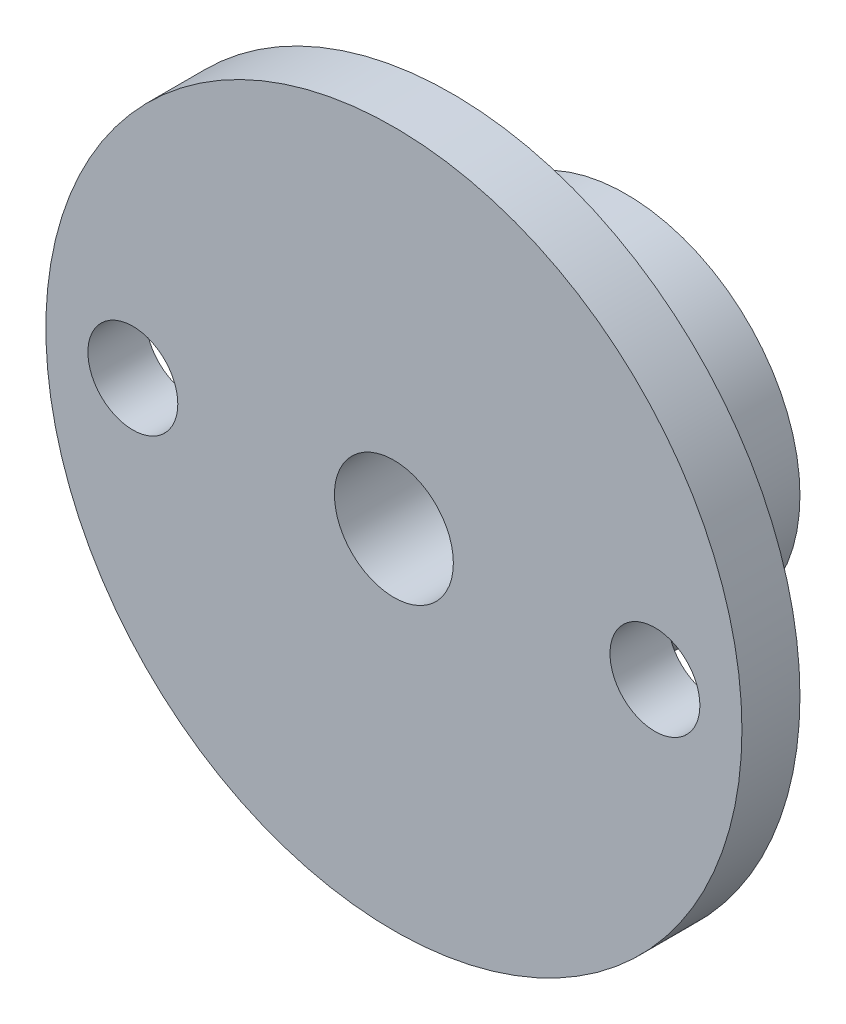
ISO-10303-21;
HEADER;
FILE_DESCRIPTION(('STEP AP214'),'2;1');
FILE_NAME('part.step','',(''),(''),'','','');
FILE_SCHEMA(('AUTOMOTIVE_DESIGN { 1 0 10303 214 1 1 1 1 }'));
ENDSEC;
DATA;
#1=APPLICATION_CONTEXT('core data for automotive mechanical design processes');
#2=APPLICATION_PROTOCOL_DEFINITION('international standard','automotive_design',2000,#1);
#3=PRODUCT_CONTEXT('',#1,'mechanical');
#4=PRODUCT('Part','Part','',(#3));
#5=PRODUCT_RELATED_PRODUCT_CATEGORY('part','',(#4));
#6=PRODUCT_DEFINITION_FORMATION('','',#4);
#7=PRODUCT_DEFINITION_CONTEXT('part definition',#1,'design');
#8=PRODUCT_DEFINITION('design','',#6,#7);
#9=PRODUCT_DEFINITION_SHAPE('','',#8);
#10=(LENGTH_UNIT() NAMED_UNIT(*) SI_UNIT(.MILLI.,.METRE.));
#11=(NAMED_UNIT(*) PLANE_ANGLE_UNIT() SI_UNIT($,.RADIAN.));
#12=(NAMED_UNIT(*) SI_UNIT($,.STERADIAN.) SOLID_ANGLE_UNIT());
#13=UNCERTAINTY_MEASURE_WITH_UNIT(LENGTH_MEASURE(1.E-05),#10,'distance_accuracy_value','');
#14=(GEOMETRIC_REPRESENTATION_CONTEXT(3) GLOBAL_UNCERTAINTY_ASSIGNED_CONTEXT((#13)) GLOBAL_UNIT_ASSIGNED_CONTEXT((#10,
#11,#12)) REPRESENTATION_CONTEXT('',''));
#15=CARTESIAN_POINT('',(0.,0.,0.));
#16=DIRECTION('',(0.,0.,1.));
#17=DIRECTION('',(1.,0.,0.));
#18=AXIS2_PLACEMENT_3D('',#15,#16,#17);
#19=CARTESIAN_POINT('',(0.,0.,6.));
#20=DIRECTION('',(0.,0.,-1.));
#21=DIRECTION('',(-1.,0.,0.));
#22=AXIS2_PLACEMENT_3D('',#19,#20,#21);
#23=CYLINDRICAL_SURFACE('',#22,6.);
#24=CARTESIAN_POINT('',(0.,-6.,4.5));
#25=CARTESIAN_POINT('',(0.0828760886697294,-5.99999859868013,4.49999767426184));
#26=CARTESIAN_POINT('',(0.165778157830762,-5.99826578131828,4.49310844922621));
#27=CARTESIAN_POINT('',(0.329206323770531,-5.99152113829892,4.465774848693));
#28=CARTESIAN_POINT('',(0.409731046870737,-5.98650745419968,4.44532279046215));
#29=CARTESIAN_POINT('',(0.566020872182575,-5.9737562633204,4.39156074653791));
#30=CARTESIAN_POINT('',(0.641791563430001,-5.96602202842087,4.35826620128472));
#31=CARTESIAN_POINT('',(0.786672131904424,-5.94865343807593,4.27981860995517));
#32=CARTESIAN_POINT('',(0.855781784348757,-5.9390190185405,4.23466516388106));
#33=CARTESIAN_POINT('',(0.986801927300918,-5.91867413591801,4.13279921034579));
#34=CARTESIAN_POINT('',(1.04855569006107,-5.90794707148533,4.07588842504082));
#35=CARTESIAN_POINT('',(1.1617489272033,-5.8867362011753,3.95254779509108));
#36=CARTESIAN_POINT('',(1.21318723694913,-5.87625242288349,3.8861168770535));
#37=CARTESIAN_POINT('',(1.30502654279903,-5.8565477569971,3.74440477326256));
#38=CARTESIAN_POINT('',(1.34525221592535,-5.84734794470605,3.6690067691896));
#39=CARTESIAN_POINT('',(1.41239690855053,-5.83149494812223,3.51225158834164));
#40=CARTESIAN_POINT('',(1.43931805543933,-5.82484135672789,3.43089536667424));
#41=CARTESIAN_POINT('',(1.47855483680429,-5.81500476717551,3.26625650179753));
#42=CARTESIAN_POINT('',(1.49115226833334,-5.81175491075426,3.1830451039502));
#43=CARTESIAN_POINT('',(1.50226177506785,-5.80889362537741,3.01563143098602));
#44=CARTESIAN_POINT('',(1.50077614181798,-5.80928160448644,2.93142931930139));
#45=CARTESIAN_POINT('',(1.48398652463928,-5.81359205496618,2.76658419225552));
#46=CARTESIAN_POINT('',(1.46901834019052,-5.81742863001879,2.68590437853491));
#47=CARTESIAN_POINT('',(1.4262241869031,-5.82806709676484,2.52823894908871));
#48=CARTESIAN_POINT('',(1.39839730206942,-5.83486919970697,2.45125359697102));
#49=CARTESIAN_POINT('',(1.33038947793715,-5.85075113904187,2.30226198374794));
#50=CARTESIAN_POINT('',(1.29008666723291,-5.85985327469421,2.23031382821045));
#51=CARTESIAN_POINT('',(1.19835627601495,-5.87929710846386,2.09408129024316));
#52=CARTESIAN_POINT('',(1.14692674880884,-5.88963902334735,2.02979825193275));
#53=CARTESIAN_POINT('',(1.03266342468122,-5.91075880539781,1.9087963843056));
#54=CARTESIAN_POINT('',(0.969546258165859,-5.92154069477971,1.85234550993865));
#55=CARTESIAN_POINT('',(0.834611917503699,-5.94205965578786,1.7507787575361));
#56=CARTESIAN_POINT('',(0.762794477707943,-5.95179669549415,1.70566322573644));
#57=CARTESIAN_POINT('',(0.612115888681391,-5.96917732094183,1.62794941377562));
#58=CARTESIAN_POINT('',(0.533231393208623,-5.97681360127725,1.59539465974557));
#59=CARTESIAN_POINT('',(0.370876008142882,-5.98907916991419,1.54408269429043));
#60=CARTESIAN_POINT('',(0.287405999150484,-5.99370903339281,1.52532284358186));
#61=CARTESIAN_POINT('',(0.120539970390026,-5.99935499271375,1.50254243444116));
#62=CARTESIAN_POINT('',(0.0371967199882084,-6.00046053508279,1.4981569739247));
#63=CARTESIAN_POINT('',(-0.129032874801509,-5.99918804814451,1.50324900205549));
#64=CARTESIAN_POINT('',(-0.211919259644596,-5.99681033241847,1.51272524279913));
#65=CARTESIAN_POINT('',(-0.373614268776493,-5.98889581127357,1.54497090839138));
#66=CARTESIAN_POINT('',(-0.452465118968756,-5.98340634185811,1.56754126347699));
#67=CARTESIAN_POINT('',(-0.605257292452512,-5.96988706634134,1.62510708402845));
#68=CARTESIAN_POINT('',(-0.679198119032636,-5.96185700369892,1.66010380431317));
#69=CARTESIAN_POINT('',(-0.821523134429848,-5.9439330792631,1.74223612887473));
#70=CARTESIAN_POINT('',(-0.889785441835831,-5.93400867366932,1.78957611239676));
#71=CARTESIAN_POINT('',(-1.01752661364325,-5.91344509187419,1.89478990879697));
#72=CARTESIAN_POINT('',(-1.07700395897301,-5.90280579251705,1.95266553961691));
#73=CARTESIAN_POINT('',(-1.18699056807273,-5.88168956960771,2.07900196084446));
#74=CARTESIAN_POINT('',(-1.23724386762203,-5.87122304187281,2.14768770300242));
#75=CARTESIAN_POINT('',(-1.3255107590127,-5.85192878377239,2.29273263446572));
#76=CARTESIAN_POINT('',(-1.36352489415794,-5.84310098067026,2.36909148295975));
#77=CARTESIAN_POINT('',(-1.42595142060929,-5.82818094734665,2.52690572241308));
#78=CARTESIAN_POINT('',(-1.45044439665407,-5.82207255291906,2.60832762834401));
#79=CARTESIAN_POINT('',(-1.48534565995378,-5.81326744090184,2.77430963788911));
#80=CARTESIAN_POINT('',(-1.49575702747866,-5.81056997719936,2.85886905103249));
#81=CARTESIAN_POINT('',(-1.502038590334,-5.80894901203957,3.0261210238552));
#82=CARTESIAN_POINT('',(-1.49831789778012,-5.80991932728264,3.10879743512473));
#83=CARTESIAN_POINT('',(-1.47737727831287,-5.81527909007843,3.27230388866798));
#84=CARTESIAN_POINT('',(-1.46015762268677,-5.81966846891857,3.35313396801365));
#85=CARTESIAN_POINT('',(-1.4129313194428,-5.83131260682723,3.51020845906541));
#86=CARTESIAN_POINT('',(-1.38300140468038,-5.83855015236309,3.58647730524021));
#87=CARTESIAN_POINT('',(-1.31126491360507,-5.85507755724829,3.73296538271369));
#88=CARTESIAN_POINT('',(-1.26945669003419,-5.86436770120773,3.80318377318692));
#89=CARTESIAN_POINT('',(-1.17386774863714,-5.88425634263512,3.93755462900202));
#90=CARTESIAN_POINT('',(-1.11980316291226,-5.89488264831757,4.00150107342396));
#91=CARTESIAN_POINT('',(-1.00178937118974,-5.91608027246286,4.11954704479541));
#92=CARTESIAN_POINT('',(-0.937837821261147,-5.9266515772706,4.17364423011297));
#93=CARTESIAN_POINT('',(-0.800467586702591,-5.94677655647663,4.27141130856461));
#94=CARTESIAN_POINT('',(-0.726898422316388,-5.95630833365868,4.31487461367158));
#95=CARTESIAN_POINT('',(-0.573266059510478,-5.97304924975118,4.38874746294053));
#96=CARTESIAN_POINT('',(-0.493207563436741,-5.98026005199781,4.41916636064854));
#97=CARTESIAN_POINT('',(-0.344410253243474,-5.99048059565542,4.46157183032965));
#98=CARTESIAN_POINT('',(-0.27638017090807,-5.99402585052691,4.47595124305343));
#99=CARTESIAN_POINT('',(-0.138906071536285,-5.99878605231948,4.49516594362194));
#100=CARTESIAN_POINT('',(-0.0694621612426181,-6.00000117450894,4.5000019493053));
#101=CARTESIAN_POINT('',(0.,-6.,4.5));
#102=B_SPLINE_CURVE_WITH_KNOTS('',3,(#24,#25,#26,#27,#28,#29,#30,#31,#32,#33,#34,#35,#36,#37,
#38,#39,#40,#41,#42,#43,#44,#45,#46,#47,#48,#49,#50,#51,#52,#53,#54,#55,#56,#57,#58,#59,#60,#61,
#62,#63,#64,#65,#66,#67,#68,#69,#70,#71,#72,#73,#74,#75,#76,#77,#78,#79,#80,#81,#82,#83,#84,#85,
#86,#87,#88,#89,#90,#91,#92,#93,#94,#95,#96,#97,#98,#99,#100,#101),.UNSPECIFIED.,.T.,.F.,(4,2,2,
2,2,2,2,2,2,2,2,2,2,2,2,2,2,2,2,2,2,2,2,2,2,2,2,2,2,2,2,2,2,2,2,2,2,2,4),(0.,0.24837371247189,
0.496888237763899,0.745104902286106,0.993329940169327,1.24614435437139,1.49898729580062,
1.75558647545807,2.01214461169368,2.2635629509943,2.51494038112697,2.76022497007018,
3.00552703466038,3.25330527873879,3.50112690836163,3.75601500969019,4.01091089558247,
4.26668229009114,4.52240473688643,4.77158308949276,5.02073901112743,5.26620274514037,
5.5116912732229,5.76153587565352,6.01142363008019,6.26744509204476,6.52345518749508,
6.77792254614036,7.03233423252408,7.27943780398612,7.52653640956034,7.77216400559447,
8.01782568136901,8.2698957640991,8.52202569770417,8.77872185499588,9.0352336382135,
9.24342242942149,9.45159556043039),.UNSPECIFIED.);
#103=CARTESIAN_POINT('',(0.,-6.,4.5));
#104=VERTEX_POINT('',#103);
#105=EDGE_CURVE('E66',#104,#104,#102,.T.);
#106=ORIENTED_EDGE('',*,*,#105,.T.);
#107=EDGE_LOOP('',(#106));
#108=FACE_BOUND('',#107,.T.);
#109=CARTESIAN_POINT('',(0.,0.,6.));
#110=DIRECTION('',(0.,0.,1.));
#111=DIRECTION('',(1.,0.,0.));
#112=AXIS2_PLACEMENT_3D('',#109,#110,#111);
#113=CIRCLE('',#112,6.);
#114=CARTESIAN_POINT('',(6.,0.,6.));
#115=VERTEX_POINT('',#114);
#116=EDGE_CURVE('E10',#115,#115,#113,.T.);
#117=ORIENTED_EDGE('',*,*,#116,.F.);
#118=EDGE_LOOP('',(#117));
#119=FACE_BOUND('',#118,.T.);
#120=CARTESIAN_POINT('',(0.,0.,0.));
#121=DIRECTION('',(0.,0.,1.));
#122=DIRECTION('',(1.,0.,0.));
#123=AXIS2_PLACEMENT_3D('',#120,#121,#122);
#124=CIRCLE('',#123,6.);
#125=CARTESIAN_POINT('',(6.,0.,0.));
#126=VERTEX_POINT('',#125);
#127=EDGE_CURVE('E36',#126,#126,#124,.T.);
#128=ORIENTED_EDGE('',*,*,#127,.T.);
#129=EDGE_LOOP('',(#128));
#130=FACE_BOUND('',#129,.T.);
#131=ADVANCED_FACE('F24',(#108,#119,#130),#23,.T.);
#132=CARTESIAN_POINT('',(0.,0.,0.));
#133=DIRECTION('',(0.,0.,1.));
#134=DIRECTION('',(1.,0.,0.));
#135=AXIS2_PLACEMENT_3D('',#132,#133,#134);
#136=PLANE('',#135);
#137=CARTESIAN_POINT('',(0.,0.,0.));
#138=DIRECTION('',(0.,0.,1.));
#139=DIRECTION('',(1.,0.,0.));
#140=AXIS2_PLACEMENT_3D('',#137,#138,#139);
#141=CIRCLE('',#140,2.05);
#142=CARTESIAN_POINT('',(2.05,0.,0.));
#143=VERTEX_POINT('',#142);
#144=EDGE_CURVE('E48',#143,#143,#141,.T.);
#145=ORIENTED_EDGE('',*,*,#144,.T.);
#146=EDGE_LOOP('',(#145));
#147=FACE_BOUND('',#146,.T.);
#148=ORIENTED_EDGE('',*,*,#127,.F.);
#149=EDGE_LOOP('',(#148));
#150=FACE_BOUND('',#149,.T.);
#151=ADVANCED_FACE('F93',(#147,#150),#136,.F.);
#152=CARTESIAN_POINT('',(0.,0.,6.));
#153=DIRECTION('',(0.,0.,1.));
#154=DIRECTION('',(1.,0.,0.));
#155=AXIS2_PLACEMENT_3D('',#152,#153,#154);
#156=PLANE('',#155);
#157=CARTESIAN_POINT('',(9.,0.,6.));
#158=DIRECTION('',(0.,0.,1.));
#159=DIRECTION('',(1.,0.,0.));
#160=AXIS2_PLACEMENT_3D('',#157,#158,#159);
#161=CIRCLE('',#160,1.55);
#162=CARTESIAN_POINT('',(10.55,0.,6.));
#163=VERTEX_POINT('',#162);
#164=EDGE_CURVE('E60',#163,#163,#161,.T.);
#165=ORIENTED_EDGE('',*,*,#164,.T.);
#166=EDGE_LOOP('',(#165));
#167=FACE_BOUND('',#166,.T.);
#168=CARTESIAN_POINT('',(-9.,0.,6.));
#169=DIRECTION('',(0.,0.,1.));
#170=DIRECTION('',(1.,0.,0.));
#171=AXIS2_PLACEMENT_3D('',#168,#169,#170);
#172=CIRCLE('',#171,1.55);
#173=CARTESIAN_POINT('',(-7.45,0.,6.));
#174=VERTEX_POINT('',#173);
#175=EDGE_CURVE('E54',#174,#174,#172,.T.);
#176=ORIENTED_EDGE('',*,*,#175,.T.);
#177=EDGE_LOOP('',(#176));
#178=FACE_BOUND('',#177,.T.);
#179=CARTESIAN_POINT('',(0.,0.,6.));
#180=DIRECTION('',(0.,0.,1.));
#181=DIRECTION('',(1.,0.,0.));
#182=AXIS2_PLACEMENT_3D('',#179,#180,#181);
#183=CIRCLE('',#182,12.);
#184=CARTESIAN_POINT('',(12.,0.,6.));
#185=VERTEX_POINT('',#184);
#186=EDGE_CURVE('E45',#185,#185,#183,.T.);
#187=ORIENTED_EDGE('',*,*,#186,.F.);
#188=EDGE_LOOP('',(#187));
#189=FACE_BOUND('',#188,.T.);
#190=ORIENTED_EDGE('',*,*,#116,.T.);
#191=EDGE_LOOP('',(#190));
#192=FACE_BOUND('',#191,.T.);
#193=ADVANCED_FACE('F89',(#167,#178,#189,#192),#156,.F.);
#194=CARTESIAN_POINT('',(0.,0.,8.));
#195=DIRECTION('',(0.,0.,-1.));
#196=DIRECTION('',(-1.,0.,0.));
#197=AXIS2_PLACEMENT_3D('',#194,#195,#196);
#198=CYLINDRICAL_SURFACE('',#197,12.);
#199=CARTESIAN_POINT('',(0.,0.,8.));
#200=DIRECTION('',(0.,0.,1.));
#201=DIRECTION('',(1.,0.,0.));
#202=AXIS2_PLACEMENT_3D('',#199,#200,#201);
#203=CIRCLE('',#202,12.);
#204=CARTESIAN_POINT('',(12.,0.,8.));
#205=VERTEX_POINT('',#204);
#206=EDGE_CURVE('E40',#205,#205,#203,.T.);
#207=ORIENTED_EDGE('',*,*,#206,.F.);
#208=EDGE_LOOP('',(#207));
#209=FACE_BOUND('',#208,.T.);
#210=ORIENTED_EDGE('',*,*,#186,.T.);
#211=EDGE_LOOP('',(#210));
#212=FACE_BOUND('',#211,.T.);
#213=ADVANCED_FACE('F92',(#209,#212),#198,.T.);
#214=CARTESIAN_POINT('',(0.,0.,8.));
#215=DIRECTION('',(0.,0.,1.));
#216=DIRECTION('',(1.,0.,0.));
#217=AXIS2_PLACEMENT_3D('',#214,#215,#216);
#218=PLANE('',#217);
#219=CARTESIAN_POINT('',(9.,0.,8.));
#220=DIRECTION('',(0.,0.,1.));
#221=DIRECTION('',(1.,0.,0.));
#222=AXIS2_PLACEMENT_3D('',#219,#220,#221);
#223=CIRCLE('',#222,1.55);
#224=CARTESIAN_POINT('',(10.55,0.,8.));
#225=VERTEX_POINT('',#224);
#226=EDGE_CURVE('E63',#225,#225,#223,.T.);
#227=ORIENTED_EDGE('',*,*,#226,.F.);
#228=EDGE_LOOP('',(#227));
#229=FACE_BOUND('',#228,.T.);
#230=CARTESIAN_POINT('',(-9.,0.,8.));
#231=DIRECTION('',(0.,0.,1.));
#232=DIRECTION('',(1.,0.,0.));
#233=AXIS2_PLACEMENT_3D('',#230,#231,#232);
#234=CIRCLE('',#233,1.55);
#235=CARTESIAN_POINT('',(-7.45,0.,8.));
#236=VERTEX_POINT('',#235);
#237=EDGE_CURVE('E57',#236,#236,#234,.T.);
#238=ORIENTED_EDGE('',*,*,#237,.F.);
#239=EDGE_LOOP('',(#238));
#240=FACE_BOUND('',#239,.T.);
#241=CARTESIAN_POINT('',(0.,0.,8.));
#242=DIRECTION('',(0.,0.,1.));
#243=DIRECTION('',(1.,0.,0.));
#244=AXIS2_PLACEMENT_3D('',#241,#242,#243);
#245=CIRCLE('',#244,2.05);
#246=CARTESIAN_POINT('',(2.05,0.,8.));
#247=VERTEX_POINT('',#246);
#248=EDGE_CURVE('E51',#247,#247,#245,.T.);
#249=ORIENTED_EDGE('',*,*,#248,.F.);
#250=EDGE_LOOP('',(#249));
#251=FACE_BOUND('',#250,.T.);
#252=ORIENTED_EDGE('',*,*,#206,.T.);
#253=EDGE_LOOP('',(#252));
#254=FACE_BOUND('',#253,.T.);
#255=ADVANCED_FACE('F87',(#229,#240,#251,#254),#218,.T.);
#256=CARTESIAN_POINT('',(0.,0.,0.));
#257=DIRECTION('',(0.,0.,1.));
#258=DIRECTION('',(1.,0.,0.));
#259=AXIS2_PLACEMENT_3D('',#256,#257,#258);
#260=CYLINDRICAL_SURFACE('',#259,2.05);
#261=CARTESIAN_POINT('',(0.,-2.05,4.5));
#262=CARTESIAN_POINT('',(-0.0736645541699394,-2.04999557455054,4.49999536487032));
#263=CARTESIAN_POINT('',(-0.147451361580436,-2.04598708706443,4.49452985480854));
#264=CARTESIAN_POINT('',(-0.292720171427363,-2.03031628176041,4.47300264589157));
#265=CARTESIAN_POINT('',(-0.364195790279564,-2.01863439721989,4.45691385773748));
#266=CARTESIAN_POINT('',(-0.502351269043643,-1.98874583853753,4.41521015882617));
#267=CARTESIAN_POINT('',(-0.569056984261831,-1.97057814890178,4.38965213123984));
#268=CARTESIAN_POINT('',(-0.696820466780423,-1.92910828401678,4.33019240013698));
#269=CARTESIAN_POINT('',(-0.757879974929626,-1.90580769889566,4.29629328024158));
#270=CARTESIAN_POINT('',(-0.878974600164132,-1.85327996587474,4.21781635944393));
#271=CARTESIAN_POINT('',(-0.938407453909169,-1.82370598176577,4.17254625481528));
#272=CARTESIAN_POINT('',(-1.04935746875454,-1.76220961079271,4.07440515478498));
#273=CARTESIAN_POINT('',(-1.10086192304519,-1.73028357291086,4.02152221546021));
#274=CARTESIAN_POINT('',(-1.20473615097505,-1.6600461859559,3.89796326977443));
#275=CARTESIAN_POINT('',(-1.25534711008369,-1.62169397672011,3.82582405496822));
#276=CARTESIAN_POINT('',(-1.34385567293754,-1.54913319052267,3.67222299041084));
#277=CARTESIAN_POINT('',(-1.38177233083955,-1.5149184529776,3.59077536135073));
#278=CARTESIAN_POINT('',(-1.43291459132733,-1.46631010290269,3.44771456900897));
#279=CARTESIAN_POINT('',(-1.45015813606169,-1.4491081113302,3.38850503166973));
#280=CARTESIAN_POINT('',(-1.47735605187029,-1.42137280086755,3.26698008652806));
#281=CARTESIAN_POINT('',(-1.4873267292953,-1.41082457094183,3.2046719634117));
#282=CARTESIAN_POINT('',(-1.49933424266878,-1.39806424591683,3.07791666053465));
#283=CARTESIAN_POINT('',(-1.50131036964724,-1.39591594223184,3.01345684708371));
#284=CARTESIAN_POINT('',(-1.49697487005051,-1.40056141611663,2.88512505475285));
#285=CARTESIAN_POINT('',(-1.49065746079277,-1.40736143292628,2.82125351733047));
#286=CARTESIAN_POINT('',(-1.46914421467263,-1.42981581835315,2.68923178006345));
#287=CARTESIAN_POINT('',(-1.45304431394653,-1.44636569534487,2.6213888526529));
#288=CARTESIAN_POINT('',(-1.41241800405743,-1.48606089204735,2.4902836175254));
#289=CARTESIAN_POINT('',(-1.38787183385896,-1.50922165684335,2.42703247688767));
#290=CARTESIAN_POINT('',(-1.32149425773126,-1.56803362426462,2.2846054484429));
#291=CARTESIAN_POINT('',(-1.27662069854312,-1.605233434408,2.20749468218742));
#292=CARTESIAN_POINT('',(-1.17456012669744,-1.68136246377685,2.0628485386396));
#293=CARTESIAN_POINT('',(-1.1173592530454,-1.72029359028535,1.99532408326575));
#294=CARTESIAN_POINT('',(-0.990371112630746,-1.79644834867789,1.86985179892646));
#295=CARTESIAN_POINT('',(-0.920423005713055,-1.8336414964417,1.81204695505277));
#296=CARTESIAN_POINT('',(-0.769268005228422,-1.90199023539516,1.70905319594615));
#297=CARTESIAN_POINT('',(-0.688087552764538,-1.9331596052877,1.66383538234152));
#298=CARTESIAN_POINT('',(-0.538207436597274,-1.97922123004423,1.59814062240448));
#299=CARTESIAN_POINT('',(-0.471634462119275,-1.99623772718083,1.57429332526309));
#300=CARTESIAN_POINT('',(-0.334527315040306,-2.02372535847694,1.53605216140614));
#301=CARTESIAN_POINT('',(-0.263996112133563,-2.03420133002224,1.52165130768186));
#302=CARTESIAN_POINT('',(-0.120600145325723,-2.04772049374847,1.50310319342416));
#303=CARTESIAN_POINT('',(-0.0477275087898649,-2.05073519152121,1.49899524047133));
#304=CARTESIAN_POINT('',(0.0977467281938146,-2.04895968464559,1.50142177556858));
#305=CARTESIAN_POINT('',(0.170348323545055,-2.04416933396684,1.50795646273963));
#306=CARTESIAN_POINT('',(0.308724365763488,-2.02774746830803,1.53053937748139));
#307=CARTESIAN_POINT('',(0.374648148974849,-2.01653935117606,1.54599926266328));
#308=CARTESIAN_POINT('',(0.502713167981759,-1.98848713080471,1.58516175245188));
#309=CARTESIAN_POINT('',(0.564853610518929,-1.97164185039048,1.60886607873626));
#310=CARTESIAN_POINT('',(0.689132816852739,-1.9318878201279,1.66578136118287));
#311=CARTESIAN_POINT('',(0.750866850830904,-1.90859948458405,1.69960507457239));
#312=CARTESIAN_POINT('',(0.867968847215969,-1.85827866471816,1.7746532538988));
#313=CARTESIAN_POINT('',(0.923332753094362,-1.83124381848865,1.81588239332167));
#314=CARTESIAN_POINT('',(1.03682397286532,-1.76985341439226,1.91300685825464));
#315=CARTESIAN_POINT('',(1.09360081170611,-1.73506384496132,1.97020532182987));
#316=CARTESIAN_POINT('',(1.19731087491147,-1.66518962228043,2.09285800989506));
#317=CARTESIAN_POINT('',(1.24423528561181,-1.6301047337781,2.15831954316177));
#318=CARTESIAN_POINT('',(1.32312902288905,-1.56656120372554,2.2896770634843));
#319=CARTESIAN_POINT('',(1.35615882476119,-1.53779480627221,2.35478433714041));
#320=CARTESIAN_POINT('',(1.41291272063144,-1.48581938303921,2.49098740743026));
#321=CARTESIAN_POINT('',(1.43665621646698,-1.46259881036972,2.56207033727716));
#322=CARTESIAN_POINT('',(1.46935149073412,-1.42965818089487,2.69266776876887));
#323=CARTESIAN_POINT('',(1.48043349891081,-1.41807300341029,2.75116597985044));
#324=CARTESIAN_POINT('',(1.49555161797816,-1.40212425294942,2.8700034275123));
#325=CARTESIAN_POINT('',(1.49959826077462,-1.39774988593687,2.93033977438546));
#326=CARTESIAN_POINT('',(1.5003451977955,-1.3969485321308,3.05124125605515));
#327=CARTESIAN_POINT('',(1.4970300729804,-1.40053822585011,3.11180660530967));
#328=CARTESIAN_POINT('',(1.48329148070309,-1.41507599115702,3.23124363534277));
#329=CARTESIAN_POINT('',(1.47285823479779,-1.42603418484414,3.29011287000658));
#330=CARTESIAN_POINT('',(1.44154573019902,-1.45776156448448,3.42160815870621));
#331=CARTESIAN_POINT('',(1.41850812555956,-1.48045941002889,3.49324268872674));
#332=CARTESIAN_POINT('',(1.36303990157746,-1.53168111814912,3.63058590116442));
#333=CARTESIAN_POINT('',(1.33058477026104,-1.56022012626716,3.6962785250729));
#334=CARTESIAN_POINT('',(1.24746944408314,-1.62785001356673,3.83799881911068));
#335=CARTESIAN_POINT('',(1.19426424774972,-1.6677337957351,3.91215634501249));
#336=CARTESIAN_POINT('',(1.07522193889443,-1.7468573131283,4.04984071490974));
#337=CARTESIAN_POINT('',(1.00939267395048,-1.78609743211258,4.11337411755238));
#338=CARTESIAN_POINT('',(0.877107798536321,-1.85413298021575,4.21929193666004));
#339=CARTESIAN_POINT('',(0.812406788660297,-1.88359794901534,4.26343243761176));
#340=CARTESIAN_POINT('',(0.67515746067032,-1.93702407432252,4.34178399156384));
#341=CARTESIAN_POINT('',(0.602617105963947,-1.96099074025875,4.37600499327855));
#342=CARTESIAN_POINT('',(0.462317192011554,-1.99830790110585,4.42864391198433));
#343=CARTESIAN_POINT('',(0.395431009217097,-2.01270292850566,4.44864837926339));
#344=CARTESIAN_POINT('',(0.258550164418264,-2.0348035590171,4.47920215510696));
#345=CARTESIAN_POINT('',(0.188564056942653,-2.04252649622795,4.48977596685669));
#346=CARTESIAN_POINT('',(0.0984524426773305,-2.04772982798432,4.49689598733902));
#347=CARTESIAN_POINT('',(0.0787929080878778,-2.048579801482,4.49805858516581));
#348=CARTESIAN_POINT('',(0.0394251721090265,-2.04971551310578,4.49961125748875));
#349=CARTESIAN_POINT('',(0.019716965240558,-2.05000118451044,4.50000124063319));
#350=CARTESIAN_POINT('',(0.,-2.05,4.5));
#351=B_SPLINE_CURVE_WITH_KNOTS('',3,(#261,#262,#263,#264,#265,#266,#267,#268,#269,#270,#271,
#272,#273,#274,#275,#276,#277,#278,#279,#280,#281,#282,#283,#284,#285,#286,#287,#288,#289,#290,
#291,#292,#293,#294,#295,#296,#297,#298,#299,#300,#301,#302,#303,#304,#305,#306,#307,#308,#309,
#310,#311,#312,#313,#314,#315,#316,#317,#318,#319,#320,#321,#322,#323,#324,#325,#326,#327,#328,
#329,#330,#331,#332,#333,#334,#335,#336,#337,#338,#339,#340,#341,#342,#343,#344,#345,#346,#347,
#348,#349,#350),.UNSPECIFIED.,.T.,.F.,(4,2,2,2,2,2,2,2,2,2,2,2,2,2,2,2,2,2,2,2,2,2,2,2,2,2,2,2,
2,2,2,2,2,2,2,2,2,2,2,2,2,2,2,2,4),(0.,0.220907485233337,0.442380470099748,0.662544051909396,
0.882639524557007,1.12282543414092,1.36339236819981,1.65048137899578,1.93713751648741,
2.12853026601187,2.31949256748167,2.51190230585803,2.70444627353801,2.91826981751639,
3.1325970669765,3.42110394211627,3.70993692667695,4.00270445801705,4.29479417832145,
4.51209357641629,4.72923206846164,4.9471985358974,5.16516908147474,5.37018833492614,
5.57525042805759,5.79685909676791,6.01860811491735,6.28096376393172,6.54355311721224,
6.77817738021138,7.01230879117284,7.19352509569975,7.37446988601036,7.55579401806688,
7.73736774510938,7.97186478758938,8.20697774023453,8.50435399328344,8.8015459822408,
9.05161167557909,9.30142569199744,9.51438706522724,9.72679348624617,9.7859143260036,
9.84504215561996),.UNSPECIFIED.);
#352=CARTESIAN_POINT('',(0.,-2.05,4.5));
#353=VERTEX_POINT('',#352);
#354=EDGE_CURVE('E28',#353,#353,#351,.T.);
#355=ORIENTED_EDGE('',*,*,#354,.T.);
#356=EDGE_LOOP('',(#355));
#357=FACE_BOUND('',#356,.T.);
#358=ORIENTED_EDGE('',*,*,#144,.F.);
#359=EDGE_LOOP('',(#358));
#360=FACE_BOUND('',#359,.T.);
#361=ORIENTED_EDGE('',*,*,#248,.T.);
#362=EDGE_LOOP('',(#361));
#363=FACE_BOUND('',#362,.T.);
#364=ADVANCED_FACE('F82',(#357,#360,#363),#260,.F.);
#365=CARTESIAN_POINT('',(-9.,0.,0.));
#366=DIRECTION('',(0.,0.,1.));
#367=DIRECTION('',(1.,0.,0.));
#368=AXIS2_PLACEMENT_3D('',#365,#366,#367);
#369=CYLINDRICAL_SURFACE('',#368,1.55);
#370=ORIENTED_EDGE('',*,*,#237,.T.);
#371=EDGE_LOOP('',(#370));
#372=FACE_BOUND('',#371,.T.);
#373=ORIENTED_EDGE('',*,*,#175,.F.);
#374=EDGE_LOOP('',(#373));
#375=FACE_BOUND('',#374,.T.);
#376=ADVANCED_FACE('F79',(#372,#375),#369,.F.);
#377=CARTESIAN_POINT('',(9.,0.,0.));
#378=DIRECTION('',(0.,0.,1.));
#379=DIRECTION('',(1.,0.,0.));
#380=AXIS2_PLACEMENT_3D('',#377,#378,#379);
#381=CYLINDRICAL_SURFACE('',#380,1.55);
#382=ORIENTED_EDGE('',*,*,#226,.T.);
#383=EDGE_LOOP('',(#382));
#384=FACE_BOUND('',#383,.T.);
#385=ORIENTED_EDGE('',*,*,#164,.F.);
#386=EDGE_LOOP('',(#385));
#387=FACE_BOUND('',#386,.T.);
#388=ADVANCED_FACE('F74',(#384,#387),#381,.F.);
#389=CARTESIAN_POINT('',(0.,-10.,3.));
#390=DIRECTION('',(0.,1.,0.));
#391=DIRECTION('',(0.,0.,1.));
#392=AXIS2_PLACEMENT_3D('',#389,#390,#391);
#393=CYLINDRICAL_SURFACE('',#392,1.5);
#394=ORIENTED_EDGE('',*,*,#354,.F.);
#395=EDGE_LOOP('',(#394));
#396=FACE_BOUND('',#395,.T.);
#397=ORIENTED_EDGE('',*,*,#105,.F.);
#398=EDGE_LOOP('',(#397));
#399=FACE_BOUND('',#398,.T.);
#400=ADVANCED_FACE('F70',(#396,#399),#393,.F.);
#401=CLOSED_SHELL('',(#131,#151,#193,#213,#255,#364,#376,#388,#400));
#402=MANIFOLD_SOLID_BREP('B2',#401);
#403=ADVANCED_BREP_SHAPE_REPRESENTATION('',(#18,#402),#14);
#404=SHAPE_DEFINITION_REPRESENTATION(#9,#403);
ENDSEC;
END-ISO-10303-21;
